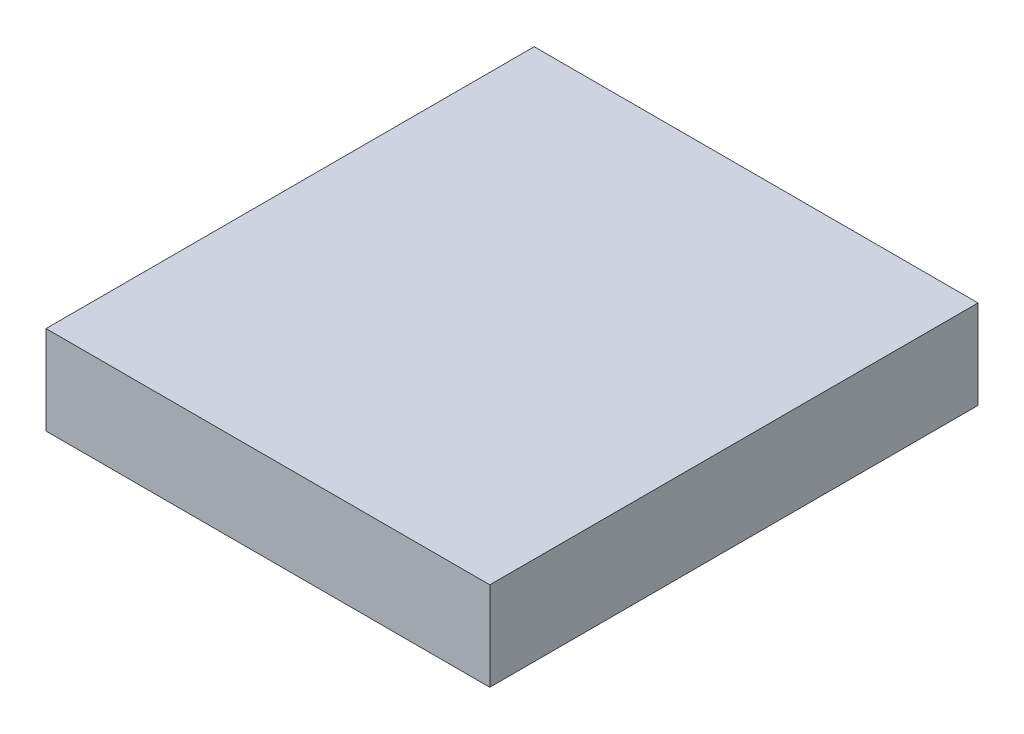
ISO-10303-21;
HEADER;
FILE_DESCRIPTION(('STEP AP214'),'2;1');
FILE_NAME('part.step','',(''),(''),'','','');
FILE_SCHEMA(('AUTOMOTIVE_DESIGN { 1 0 10303 214 1 1 1 1 }'));
ENDSEC;
DATA;
#1=APPLICATION_CONTEXT('core data for automotive mechanical design processes');
#2=APPLICATION_PROTOCOL_DEFINITION('international standard','automotive_design',2000,#1);
#3=PRODUCT_CONTEXT('',#1,'mechanical');
#4=PRODUCT('Part','Part','',(#3));
#5=PRODUCT_RELATED_PRODUCT_CATEGORY('part','',(#4));
#6=PRODUCT_DEFINITION_FORMATION('','',#4);
#7=PRODUCT_DEFINITION_CONTEXT('part definition',#1,'design');
#8=PRODUCT_DEFINITION('design','',#6,#7);
#9=PRODUCT_DEFINITION_SHAPE('','',#8);
#10=(LENGTH_UNIT() NAMED_UNIT(*) SI_UNIT(.MILLI.,.METRE.));
#11=(NAMED_UNIT(*) PLANE_ANGLE_UNIT() SI_UNIT($,.RADIAN.));
#12=(NAMED_UNIT(*) SI_UNIT($,.STERADIAN.) SOLID_ANGLE_UNIT());
#13=UNCERTAINTY_MEASURE_WITH_UNIT(LENGTH_MEASURE(1.E-05),#10,'distance_accuracy_value','');
#14=(GEOMETRIC_REPRESENTATION_CONTEXT(3) GLOBAL_UNCERTAINTY_ASSIGNED_CONTEXT((#13)) GLOBAL_UNIT_ASSIGNED_CONTEXT((#10,
#11,#12)) REPRESENTATION_CONTEXT('',''));
#15=CARTESIAN_POINT('',(0.,0.,0.));
#16=DIRECTION('',(0.,0.,1.));
#17=DIRECTION('',(1.,0.,0.));
#18=AXIS2_PLACEMENT_3D('',#15,#16,#17);
#19=CARTESIAN_POINT('',(12.5,5.,13.75));
#20=DIRECTION('',(-1.,0.,0.));
#21=DIRECTION('',(0.,0.,1.));
#22=AXIS2_PLACEMENT_3D('',#19,#20,#21);
#23=PLANE('',#22);
#24=DIRECTION('',(0.,0.,-1.));
#25=VECTOR('',#24,1.);
#26=CARTESIAN_POINT('',(12.5,0.,13.75));
#27=LINE('',#26,#25);
#28=CARTESIAN_POINT('',(12.5,0.,13.75));
#29=VERTEX_POINT('',#28);
#30=CARTESIAN_POINT('',(12.5,0.,-13.75));
#31=VERTEX_POINT('',#30);
#32=EDGE_CURVE('E98',#29,#31,#27,.T.);
#33=ORIENTED_EDGE('',*,*,#32,.T.);
#34=DIRECTION('',(0.,-1.,0.));
#35=VECTOR('',#34,1.);
#36=CARTESIAN_POINT('',(12.5,5.,-13.75));
#37=LINE('',#36,#35);
#38=CARTESIAN_POINT('',(12.5,5.,-13.75));
#39=VERTEX_POINT('',#38);
#40=EDGE_CURVE('E11',#39,#31,#37,.T.);
#41=ORIENTED_EDGE('',*,*,#40,.F.);
#42=DIRECTION('',(0.,0.,-1.));
#43=VECTOR('',#42,1.);
#44=CARTESIAN_POINT('',(12.5,5.,13.75));
#45=LINE('',#44,#43);
#46=CARTESIAN_POINT('',(12.5,5.,13.75));
#47=VERTEX_POINT('',#46);
#48=EDGE_CURVE('E86',#47,#39,#45,.T.);
#49=ORIENTED_EDGE('',*,*,#48,.F.);
#50=DIRECTION('',(0.,-1.,0.));
#51=VECTOR('',#50,1.);
#52=CARTESIAN_POINT('',(12.5,5.,13.75));
#53=LINE('',#52,#51);
#54=EDGE_CURVE('E94',#47,#29,#53,.T.);
#55=ORIENTED_EDGE('',*,*,#54,.T.);
#56=EDGE_LOOP('',(#33,#41,#49,#55));
#57=FACE_BOUND('',#56,.T.);
#58=ADVANCED_FACE('F35',(#57),#23,.F.);
#59=CARTESIAN_POINT('',(-12.5,5.,-13.75));
#60=DIRECTION('',(0.,0.,1.));
#61=DIRECTION('',(1.,0.,0.));
#62=AXIS2_PLACEMENT_3D('',#59,#60,#61);
#63=PLANE('',#62);
#64=DIRECTION('',(-1.,0.,0.));
#65=VECTOR('',#64,1.);
#66=CARTESIAN_POINT('',(-12.5,0.,-13.75));
#67=LINE('',#66,#65);
#68=CARTESIAN_POINT('',(-12.5,0.,-13.75));
#69=VERTEX_POINT('',#68);
#70=EDGE_CURVE('E90',#31,#69,#67,.T.);
#71=ORIENTED_EDGE('',*,*,#70,.T.);
#72=DIRECTION('',(0.,-1.,0.));
#73=VECTOR('',#72,1.);
#74=CARTESIAN_POINT('',(-12.5,5.,-13.75));
#75=LINE('',#74,#73);
#76=CARTESIAN_POINT('',(-12.5,5.,-13.75));
#77=VERTEX_POINT('',#76);
#78=EDGE_CURVE('E43',#77,#69,#75,.T.);
#79=ORIENTED_EDGE('',*,*,#78,.F.);
#80=DIRECTION('',(-1.,0.,0.));
#81=VECTOR('',#80,1.);
#82=CARTESIAN_POINT('',(-12.5,5.,-13.75));
#83=LINE('',#82,#81);
#84=EDGE_CURVE('E81',#39,#77,#83,.T.);
#85=ORIENTED_EDGE('',*,*,#84,.F.);
#86=ORIENTED_EDGE('',*,*,#40,.T.);
#87=EDGE_LOOP('',(#71,#79,#85,#86));
#88=FACE_BOUND('',#87,.T.);
#89=ADVANCED_FACE('F89',(#88),#63,.F.);
#90=CARTESIAN_POINT('',(-12.5,5.,13.75));
#91=DIRECTION('',(1.,0.,0.));
#92=DIRECTION('',(0.,0.,-1.));
#93=AXIS2_PLACEMENT_3D('',#90,#91,#92);
#94=PLANE('',#93);
#95=DIRECTION('',(0.,0.,1.));
#96=VECTOR('',#95,1.);
#97=CARTESIAN_POINT('',(-12.5,0.,13.75));
#98=LINE('',#97,#96);
#99=CARTESIAN_POINT('',(-12.5,0.,13.75));
#100=VERTEX_POINT('',#99);
#101=EDGE_CURVE('E68',#69,#100,#98,.T.);
#102=ORIENTED_EDGE('',*,*,#101,.T.);
#103=DIRECTION('',(0.,-1.,0.));
#104=VECTOR('',#103,1.);
#105=CARTESIAN_POINT('',(-12.5,5.,13.75));
#106=LINE('',#105,#104);
#107=CARTESIAN_POINT('',(-12.5,5.,13.75));
#108=VERTEX_POINT('',#107);
#109=EDGE_CURVE('E91',#108,#100,#106,.T.);
#110=ORIENTED_EDGE('',*,*,#109,.F.);
#111=DIRECTION('',(0.,0.,1.));
#112=VECTOR('',#111,1.);
#113=CARTESIAN_POINT('',(-12.5,5.,13.75));
#114=LINE('',#113,#112);
#115=EDGE_CURVE('E84',#77,#108,#114,.T.);
#116=ORIENTED_EDGE('',*,*,#115,.F.);
#117=ORIENTED_EDGE('',*,*,#78,.T.);
#118=EDGE_LOOP('',(#102,#110,#116,#117));
#119=FACE_BOUND('',#118,.T.);
#120=ADVANCED_FACE('F92',(#119),#94,.F.);
#121=CARTESIAN_POINT('',(-12.5,5.,13.75));
#122=DIRECTION('',(0.,0.,-1.));
#123=DIRECTION('',(-1.,0.,0.));
#124=AXIS2_PLACEMENT_3D('',#121,#122,#123);
#125=PLANE('',#124);
#126=DIRECTION('',(1.,0.,0.));
#127=VECTOR('',#126,1.);
#128=CARTESIAN_POINT('',(-12.5,0.,13.75));
#129=LINE('',#128,#127);
#130=EDGE_CURVE('E74',#100,#29,#129,.T.);
#131=ORIENTED_EDGE('',*,*,#130,.T.);
#132=ORIENTED_EDGE('',*,*,#54,.F.);
#133=DIRECTION('',(1.,0.,0.));
#134=VECTOR('',#133,1.);
#135=CARTESIAN_POINT('',(-12.5,5.,13.75));
#136=LINE('',#135,#134);
#137=EDGE_CURVE('E51',#108,#47,#136,.T.);
#138=ORIENTED_EDGE('',*,*,#137,.F.);
#139=ORIENTED_EDGE('',*,*,#109,.T.);
#140=EDGE_LOOP('',(#131,#132,#138,#139));
#141=FACE_BOUND('',#140,.T.);
#142=ADVANCED_FACE('F105',(#141),#125,.F.);
#143=CARTESIAN_POINT('',(0.,5.,0.));
#144=DIRECTION('',(0.,-1.,0.));
#145=DIRECTION('',(0.,0.,-1.));
#146=AXIS2_PLACEMENT_3D('',#143,#144,#145);
#147=PLANE('',#146);
#148=ORIENTED_EDGE('',*,*,#48,.T.);
#149=ORIENTED_EDGE('',*,*,#84,.T.);
#150=ORIENTED_EDGE('',*,*,#115,.T.);
#151=ORIENTED_EDGE('',*,*,#137,.T.);
#152=EDGE_LOOP('',(#148,#149,#150,#151));
#153=FACE_BOUND('',#152,.T.);
#154=ADVANCED_FACE('F82',(#153),#147,.F.);
#155=CARTESIAN_POINT('',(0.,0.,0.));
#156=DIRECTION('',(0.,-1.,0.));
#157=DIRECTION('',(0.,0.,-1.));
#158=AXIS2_PLACEMENT_3D('',#155,#156,#157);
#159=PLANE('',#158);
#160=ORIENTED_EDGE('',*,*,#32,.F.);
#161=ORIENTED_EDGE('',*,*,#130,.F.);
#162=ORIENTED_EDGE('',*,*,#101,.F.);
#163=ORIENTED_EDGE('',*,*,#70,.F.);
#164=EDGE_LOOP('',(#160,#161,#162,#163));
#165=FACE_BOUND('',#164,.T.);
#166=ADVANCED_FACE('F108',(#165),#159,.T.);
#167=CLOSED_SHELL('',(#58,#89,#120,#142,#154,#166));
#168=MANIFOLD_SOLID_BREP('B2',#167);
#169=ADVANCED_BREP_SHAPE_REPRESENTATION('',(#18,#168),#14);
#170=SHAPE_DEFINITION_REPRESENTATION(#9,#169);
ENDSEC;
END-ISO-10303-21;
